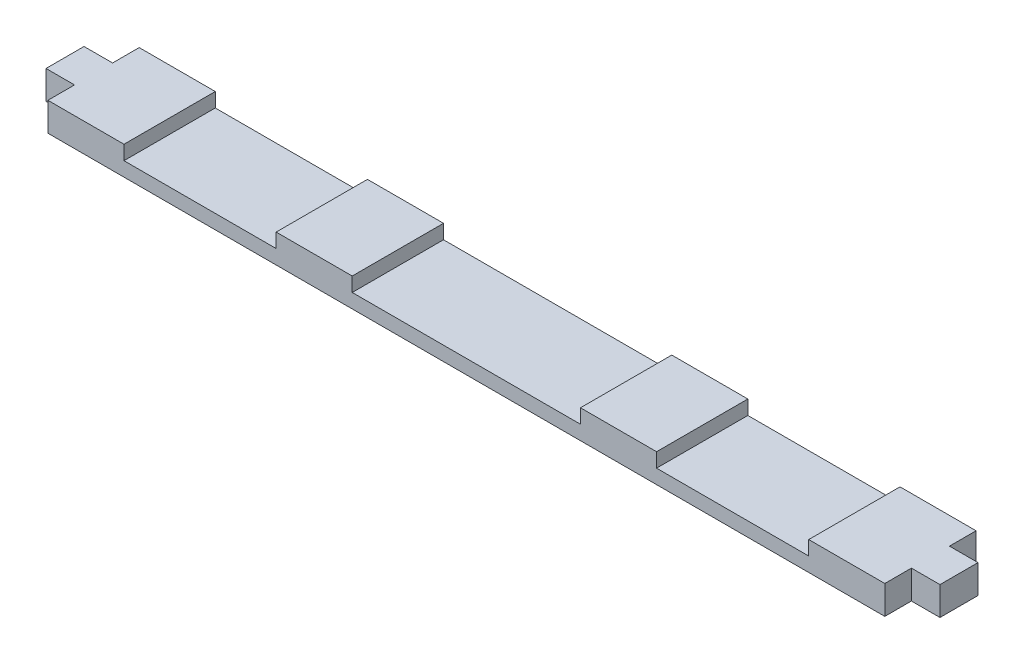
ISO-10303-21;
HEADER;
FILE_DESCRIPTION(('STEP AP214'),'2;1');
FILE_NAME('part.step','',(''),(''),'','','');
FILE_SCHEMA(('AUTOMOTIVE_DESIGN { 1 0 10303 214 1 1 1 1 }'));
ENDSEC;
DATA;
#1=APPLICATION_CONTEXT('core data for automotive mechanical design processes');
#2=APPLICATION_PROTOCOL_DEFINITION('international standard','automotive_design',2000,#1);
#3=PRODUCT_CONTEXT('',#1,'mechanical');
#4=PRODUCT('Part','Part','',(#3));
#5=PRODUCT_RELATED_PRODUCT_CATEGORY('part','',(#4));
#6=PRODUCT_DEFINITION_FORMATION('','',#4);
#7=PRODUCT_DEFINITION_CONTEXT('part definition',#1,'design');
#8=PRODUCT_DEFINITION('design','',#6,#7);
#9=PRODUCT_DEFINITION_SHAPE('','',#8);
#10=(LENGTH_UNIT() NAMED_UNIT(*) SI_UNIT(.MILLI.,.METRE.));
#11=(NAMED_UNIT(*) PLANE_ANGLE_UNIT() SI_UNIT($,.RADIAN.));
#12=(NAMED_UNIT(*) SI_UNIT($,.STERADIAN.) SOLID_ANGLE_UNIT());
#13=UNCERTAINTY_MEASURE_WITH_UNIT(LENGTH_MEASURE(1.E-05),#10,'distance_accuracy_value','');
#14=(GEOMETRIC_REPRESENTATION_CONTEXT(3) GLOBAL_UNCERTAINTY_ASSIGNED_CONTEXT((#13)) GLOBAL_UNIT_ASSIGNED_CONTEXT((#10,
#11,#12)) REPRESENTATION_CONTEXT('',''));
#15=CARTESIAN_POINT('',(0.,0.,0.));
#16=DIRECTION('',(0.,0.,1.));
#17=DIRECTION('',(1.,0.,0.));
#18=AXIS2_PLACEMENT_3D('',#15,#16,#17);
#19=CARTESIAN_POINT('',(0.,9.525,0.));
#20=DIRECTION('',(0.,1.,0.));
#21=DIRECTION('',(0.,0.,1.));
#22=AXIS2_PLACEMENT_3D('',#19,#20,#21);
#23=PLANE('',#22);
#24=DIRECTION('',(0.,0.,1.));
#25=VECTOR('',#24,1.);
#26=CARTESIAN_POINT('',(-114.3,9.525,-15.24));
#27=LINE('',#26,#25);
#28=CARTESIAN_POINT('',(-114.3,9.525,-15.24));
#29=VERTEX_POINT('',#28);
#30=CARTESIAN_POINT('',(-114.3,9.525,15.24));
#31=VERTEX_POINT('',#30);
#32=EDGE_CURVE('E216',#29,#31,#27,.T.);
#33=ORIENTED_EDGE('',*,*,#32,.F.);
#34=DIRECTION('',(-1.,0.,0.));
#35=VECTOR('',#34,1.);
#36=CARTESIAN_POINT('',(139.7,9.525,-15.24));
#37=LINE('',#36,#35);
#38=CARTESIAN_POINT('',(-139.7,9.525,-15.24));
#39=VERTEX_POINT('',#38);
#40=EDGE_CURVE('E242',#29,#39,#37,.T.);
#41=ORIENTED_EDGE('',*,*,#40,.T.);
#42=DIRECTION('',(0.,0.,1.));
#43=VECTOR('',#42,1.);
#44=CARTESIAN_POINT('',(-139.7,9.525,15.24));
#45=LINE('',#44,#43);
#46=CARTESIAN_POINT('',(-139.7,9.525,-6.35000000000001));
#47=VERTEX_POINT('',#46);
#48=EDGE_CURVE('E326',#39,#47,#45,.T.);
#49=ORIENTED_EDGE('',*,*,#48,.T.);
#50=DIRECTION('',(1.,0.,0.));
#51=VECTOR('',#50,1.);
#52=CARTESIAN_POINT('',(-149.225,9.525,-6.35000000000002));
#53=LINE('',#52,#51);
#54=CARTESIAN_POINT('',(-149.225,9.525,-6.35000000000002));
#55=VERTEX_POINT('',#54);
#56=EDGE_CURVE('E311',#55,#47,#53,.T.);
#57=ORIENTED_EDGE('',*,*,#56,.F.);
#58=DIRECTION('',(0.,0.,1.));
#59=VECTOR('',#58,1.);
#60=CARTESIAN_POINT('',(-149.225,9.525,6.34999999999998));
#61=LINE('',#60,#59);
#62=CARTESIAN_POINT('',(-149.225,9.525,6.34999999999998));
#63=VERTEX_POINT('',#62);
#64=EDGE_CURVE('E444',#55,#63,#61,.T.);
#65=ORIENTED_EDGE('',*,*,#64,.T.);
#66=DIRECTION('',(1.,0.,0.));
#67=VECTOR('',#66,1.);
#68=CARTESIAN_POINT('',(-149.225,9.525,6.34999999999998));
#69=LINE('',#68,#67);
#70=CARTESIAN_POINT('',(-139.7,9.525,6.34999999999998));
#71=VERTEX_POINT('',#70);
#72=EDGE_CURVE('E304',#63,#71,#69,.T.);
#73=ORIENTED_EDGE('',*,*,#72,.T.);
#74=CARTESIAN_POINT('',(-139.7,9.525,15.24));
#75=VERTEX_POINT('',#74);
#76=EDGE_CURVE('E263',#71,#75,#45,.T.);
#77=ORIENTED_EDGE('',*,*,#76,.T.);
#78=DIRECTION('',(1.,0.,0.));
#79=VECTOR('',#78,1.);
#80=CARTESIAN_POINT('',(139.7,9.525,15.24));
#81=LINE('',#80,#79);
#82=EDGE_CURVE('E330',#75,#31,#81,.T.);
#83=ORIENTED_EDGE('',*,*,#82,.T.);
#84=EDGE_LOOP('',(#33,#41,#49,#57,#65,#73,#77,#83));
#85=FACE_BOUND('',#84,.T.);
#86=ADVANCED_FACE('F42',(#85),#23,.T.);
#87=DIRECTION('',(0.,0.,1.));
#88=VECTOR('',#87,1.);
#89=CARTESIAN_POINT('',(63.5,9.525,-15.24));
#90=LINE('',#89,#88);
#91=CARTESIAN_POINT('',(63.5,9.525,-15.24));
#92=VERTEX_POINT('',#91);
#93=CARTESIAN_POINT('',(63.5,9.525,15.24));
#94=VERTEX_POINT('',#93);
#95=EDGE_CURVE('E206',#92,#94,#90,.T.);
#96=ORIENTED_EDGE('',*,*,#95,.F.);
#97=CARTESIAN_POINT('',(38.1,9.525,-15.24));
#98=VERTEX_POINT('',#97);
#99=EDGE_CURVE('E222',#92,#98,#37,.T.);
#100=ORIENTED_EDGE('',*,*,#99,.T.);
#101=DIRECTION('',(0.,0.,-1.));
#102=VECTOR('',#101,1.);
#103=CARTESIAN_POINT('',(38.1,9.525,-15.24));
#104=LINE('',#103,#102);
#105=CARTESIAN_POINT('',(38.1,9.525,15.24));
#106=VERTEX_POINT('',#105);
#107=EDGE_CURVE('E412',#106,#98,#104,.T.);
#108=ORIENTED_EDGE('',*,*,#107,.F.);
#109=EDGE_CURVE('E224',#106,#94,#81,.T.);
#110=ORIENTED_EDGE('',*,*,#109,.T.);
#111=EDGE_LOOP('',(#96,#100,#108,#110));
#112=FACE_BOUND('',#111,.T.);
#113=ADVANCED_FACE('F221',(#112),#23,.T.);
#114=DIRECTION('',(0.,0.,-1.));
#115=VECTOR('',#114,1.);
#116=CARTESIAN_POINT('',(-63.5,9.525,-15.24));
#117=LINE('',#116,#115);
#118=CARTESIAN_POINT('',(-63.5,9.525,15.24));
#119=VERTEX_POINT('',#118);
#120=CARTESIAN_POINT('',(-63.5,9.525,-15.24));
#121=VERTEX_POINT('',#120);
#122=EDGE_CURVE('E387',#119,#121,#117,.T.);
#123=ORIENTED_EDGE('',*,*,#122,.F.);
#124=CARTESIAN_POINT('',(-38.1,9.525,15.24));
#125=VERTEX_POINT('',#124);
#126=EDGE_CURVE('E334',#119,#125,#81,.T.);
#127=ORIENTED_EDGE('',*,*,#126,.T.);
#128=DIRECTION('',(0.,0.,1.));
#129=VECTOR('',#128,1.);
#130=CARTESIAN_POINT('',(-38.1,9.525,-15.24));
#131=LINE('',#130,#129);
#132=CARTESIAN_POINT('',(-38.1,9.525,-15.24));
#133=VERTEX_POINT('',#132);
#134=EDGE_CURVE('E226',#133,#125,#131,.T.);
#135=ORIENTED_EDGE('',*,*,#134,.F.);
#136=EDGE_CURVE('E236',#133,#121,#37,.T.);
#137=ORIENTED_EDGE('',*,*,#136,.T.);
#138=EDGE_LOOP('',(#123,#127,#135,#137));
#139=FACE_BOUND('',#138,.T.);
#140=ADVANCED_FACE('F532',(#139),#23,.T.);
#141=CARTESIAN_POINT('',(-139.7,9.525,15.24));
#142=DIRECTION('',(1.,0.,0.));
#143=DIRECTION('',(0.,0.,-1.));
#144=AXIS2_PLACEMENT_3D('',#141,#142,#143);
#145=PLANE('',#144);
#146=ORIENTED_EDGE('',*,*,#76,.F.);
#147=DIRECTION('',(0.,-1.,0.));
#148=VECTOR('',#147,1.);
#149=CARTESIAN_POINT('',(-139.7,0.,6.34999999999998));
#150=LINE('',#149,#148);
#151=CARTESIAN_POINT('',(-139.7,0.,6.34999999999998));
#152=VERTEX_POINT('',#151);
#153=EDGE_CURVE('E432',#71,#152,#150,.T.);
#154=ORIENTED_EDGE('',*,*,#153,.T.);
#155=DIRECTION('',(0.,0.,1.));
#156=VECTOR('',#155,1.);
#157=CARTESIAN_POINT('',(-139.7,0.,15.24));
#158=LINE('',#157,#156);
#159=CARTESIAN_POINT('',(-139.7,0.,15.24));
#160=VERTEX_POINT('',#159);
#161=EDGE_CURVE('E253',#152,#160,#158,.T.);
#162=ORIENTED_EDGE('',*,*,#161,.T.);
#163=DIRECTION('',(0.,-1.,0.));
#164=VECTOR('',#163,1.);
#165=CARTESIAN_POINT('',(-139.7,9.525,15.24));
#166=LINE('',#165,#164);
#167=EDGE_CURVE('E11',#75,#160,#166,.T.);
#168=ORIENTED_EDGE('',*,*,#167,.F.);
#169=EDGE_LOOP('',(#146,#154,#162,#168));
#170=FACE_BOUND('',#169,.T.);
#171=ADVANCED_FACE('F494',(#170),#145,.F.);
#172=CARTESIAN_POINT('',(139.7,9.525,15.24));
#173=DIRECTION('',(-1.,0.,0.));
#174=DIRECTION('',(0.,0.,1.));
#175=AXIS2_PLACEMENT_3D('',#172,#173,#174);
#176=PLANE('',#175);
#177=DIRECTION('',(0.,-1.,0.));
#178=VECTOR('',#177,1.);
#179=CARTESIAN_POINT('',(139.7,0.,6.34999999999998));
#180=LINE('',#179,#178);
#181=CARTESIAN_POINT('',(139.7,9.525,6.34999999999999));
#182=VERTEX_POINT('',#181);
#183=CARTESIAN_POINT('',(139.7,0.,6.34999999999999));
#184=VERTEX_POINT('',#183);
#185=EDGE_CURVE('E298',#182,#184,#180,.T.);
#186=ORIENTED_EDGE('',*,*,#185,.F.);
#187=DIRECTION('',(0.,0.,-1.));
#188=VECTOR('',#187,1.);
#189=CARTESIAN_POINT('',(139.7,9.525,15.24));
#190=LINE('',#189,#188);
#191=CARTESIAN_POINT('',(139.7,9.525,15.24));
#192=VERTEX_POINT('',#191);
#193=EDGE_CURVE('E246',#192,#182,#190,.T.);
#194=ORIENTED_EDGE('',*,*,#193,.F.);
#195=DIRECTION('',(0.,-1.,0.));
#196=VECTOR('',#195,1.);
#197=CARTESIAN_POINT('',(139.7,9.525,15.24));
#198=LINE('',#197,#196);
#199=CARTESIAN_POINT('',(139.7,0.,15.24));
#200=VERTEX_POINT('',#199);
#201=EDGE_CURVE('E51',#192,#200,#198,.T.);
#202=ORIENTED_EDGE('',*,*,#201,.T.);
#203=DIRECTION('',(0.,0.,-1.));
#204=VECTOR('',#203,1.);
#205=CARTESIAN_POINT('',(139.7,0.,15.24));
#206=LINE('',#205,#204);
#207=EDGE_CURVE('E257',#200,#184,#206,.T.);
#208=ORIENTED_EDGE('',*,*,#207,.T.);
#209=EDGE_LOOP('',(#186,#194,#202,#208));
#210=FACE_BOUND('',#209,.T.);
#211=ADVANCED_FACE('F276',(#210),#176,.F.);
#212=DIRECTION('',(0.,1.,0.));
#213=VECTOR('',#212,1.);
#214=CARTESIAN_POINT('',(139.7,0.,-6.35000000000002));
#215=LINE('',#214,#213);
#216=CARTESIAN_POINT('',(139.7,0.,-6.35000000000001));
#217=VERTEX_POINT('',#216);
#218=CARTESIAN_POINT('',(139.7,9.525,-6.35000000000002));
#219=VERTEX_POINT('',#218);
#220=EDGE_CURVE('E303',#217,#219,#215,.T.);
#221=ORIENTED_EDGE('',*,*,#220,.F.);
#222=CARTESIAN_POINT('',(139.7,0.,-15.24));
#223=VERTEX_POINT('',#222);
#224=EDGE_CURVE('E256',#217,#223,#206,.T.);
#225=ORIENTED_EDGE('',*,*,#224,.T.);
#226=DIRECTION('',(0.,-1.,0.));
#227=VECTOR('',#226,1.);
#228=CARTESIAN_POINT('',(139.7,9.525,-15.24));
#229=LINE('',#228,#227);
#230=CARTESIAN_POINT('',(139.7,9.525,-15.24));
#231=VERTEX_POINT('',#230);
#232=EDGE_CURVE('E267',#231,#223,#229,.T.);
#233=ORIENTED_EDGE('',*,*,#232,.F.);
#234=EDGE_CURVE('E333',#219,#231,#190,.T.);
#235=ORIENTED_EDGE('',*,*,#234,.F.);
#236=EDGE_LOOP('',(#221,#225,#233,#235));
#237=FACE_BOUND('',#236,.T.);
#238=ADVANCED_FACE('F487',(#237),#176,.F.);
#239=CARTESIAN_POINT('',(-139.7,0.,-15.24));
#240=VERTEX_POINT('',#239);
#241=CARTESIAN_POINT('',(-139.7,0.,-6.35000000000002));
#242=VERTEX_POINT('',#241);
#243=EDGE_CURVE('E248',#240,#242,#158,.T.);
#244=ORIENTED_EDGE('',*,*,#243,.T.);
#245=DIRECTION('',(0.,1.,0.));
#246=VECTOR('',#245,1.);
#247=CARTESIAN_POINT('',(-139.7,0.,-6.35000000000002));
#248=LINE('',#247,#246);
#249=EDGE_CURVE('E445',#242,#47,#248,.T.);
#250=ORIENTED_EDGE('',*,*,#249,.T.);
#251=ORIENTED_EDGE('',*,*,#48,.F.);
#252=DIRECTION('',(0.,-1.,0.));
#253=VECTOR('',#252,1.);
#254=CARTESIAN_POINT('',(-139.7,9.525,-15.24));
#255=LINE('',#254,#253);
#256=EDGE_CURVE('E241',#39,#240,#255,.T.);
#257=ORIENTED_EDGE('',*,*,#256,.T.);
#258=EDGE_LOOP('',(#244,#250,#251,#257));
#259=FACE_BOUND('',#258,.T.);
#260=ADVANCED_FACE('F44',(#259),#145,.F.);
#261=CARTESIAN_POINT('',(139.7,9.525,15.24));
#262=DIRECTION('',(0.,0.,-1.));
#263=DIRECTION('',(-1.,0.,0.));
#264=AXIS2_PLACEMENT_3D('',#261,#262,#263);
#265=PLANE('',#264);
#266=DIRECTION('',(1.,0.,0.));
#267=VECTOR('',#266,1.);
#268=CARTESIAN_POINT('',(-114.3,4.7625,15.24));
#269=LINE('',#268,#267);
#270=CARTESIAN_POINT('',(-114.3,4.7625,15.24));
#271=VERTEX_POINT('',#270);
#272=CARTESIAN_POINT('',(-63.5,4.7625,15.24));
#273=VERTEX_POINT('',#272);
#274=EDGE_CURVE('E400',#271,#273,#269,.T.);
#275=ORIENTED_EDGE('',*,*,#274,.F.);
#276=DIRECTION('',(0.,1.,0.));
#277=VECTOR('',#276,1.);
#278=CARTESIAN_POINT('',(-114.3,4.7625,15.24));
#279=LINE('',#278,#277);
#280=EDGE_CURVE('E372',#271,#31,#279,.T.);
#281=ORIENTED_EDGE('',*,*,#280,.T.);
#282=ORIENTED_EDGE('',*,*,#82,.F.);
#283=ORIENTED_EDGE('',*,*,#167,.T.);
#284=DIRECTION('',(1.,0.,0.));
#285=VECTOR('',#284,1.);
#286=CARTESIAN_POINT('',(139.7,0.,15.24));
#287=LINE('',#286,#285);
#288=EDGE_CURVE('E252',#160,#200,#287,.T.);
#289=ORIENTED_EDGE('',*,*,#288,.T.);
#290=ORIENTED_EDGE('',*,*,#201,.F.);
#291=CARTESIAN_POINT('',(114.3,9.525,15.24));
#292=VERTEX_POINT('',#291);
#293=EDGE_CURVE('E329',#292,#192,#81,.T.);
#294=ORIENTED_EDGE('',*,*,#293,.F.);
#295=DIRECTION('',(0.,1.,0.));
#296=VECTOR('',#295,1.);
#297=CARTESIAN_POINT('',(114.3,4.7625,15.24));
#298=LINE('',#297,#296);
#299=CARTESIAN_POINT('',(114.3,4.7625,15.24));
#300=VERTEX_POINT('',#299);
#301=EDGE_CURVE('E58',#300,#292,#298,.T.);
#302=ORIENTED_EDGE('',*,*,#301,.F.);
#303=DIRECTION('',(1.,0.,0.));
#304=VECTOR('',#303,1.);
#305=CARTESIAN_POINT('',(63.5,4.7625,15.24));
#306=LINE('',#305,#304);
#307=CARTESIAN_POINT('',(63.5,4.7625,15.24));
#308=VERTEX_POINT('',#307);
#309=EDGE_CURVE('E349',#308,#300,#306,.T.);
#310=ORIENTED_EDGE('',*,*,#309,.F.);
#311=DIRECTION('',(0.,1.,0.));
#312=VECTOR('',#311,1.);
#313=CARTESIAN_POINT('',(63.5,4.7625,15.24));
#314=LINE('',#313,#312);
#315=EDGE_CURVE('E351',#308,#94,#314,.T.);
#316=ORIENTED_EDGE('',*,*,#315,.T.);
#317=ORIENTED_EDGE('',*,*,#109,.F.);
#318=DIRECTION('',(0.,1.,0.));
#319=VECTOR('',#318,1.);
#320=CARTESIAN_POINT('',(38.1,4.7625,15.24));
#321=LINE('',#320,#319);
#322=CARTESIAN_POINT('',(38.1,4.7625,15.24));
#323=VERTEX_POINT('',#322);
#324=EDGE_CURVE('E66',#323,#106,#321,.T.);
#325=ORIENTED_EDGE('',*,*,#324,.F.);
#326=DIRECTION('',(1.,0.,0.));
#327=VECTOR('',#326,1.);
#328=CARTESIAN_POINT('',(-38.1,4.7625,15.24));
#329=LINE('',#328,#327);
#330=CARTESIAN_POINT('',(-38.1,4.7625,15.24));
#331=VERTEX_POINT('',#330);
#332=EDGE_CURVE('E411',#331,#323,#329,.T.);
#333=ORIENTED_EDGE('',*,*,#332,.F.);
#334=DIRECTION('',(0.,1.,0.));
#335=VECTOR('',#334,1.);
#336=CARTESIAN_POINT('',(-38.1,4.7625,15.24));
#337=LINE('',#336,#335);
#338=EDGE_CURVE('E424',#331,#125,#337,.T.);
#339=ORIENTED_EDGE('',*,*,#338,.T.);
#340=ORIENTED_EDGE('',*,*,#126,.F.);
#341=DIRECTION('',(0.,1.,0.));
#342=VECTOR('',#341,1.);
#343=CARTESIAN_POINT('',(-63.5,4.7625,15.24));
#344=LINE('',#343,#342);
#345=EDGE_CURVE('E377',#273,#119,#344,.T.);
#346=ORIENTED_EDGE('',*,*,#345,.F.);
#347=EDGE_LOOP('',(#275,#281,#282,#283,#289,#290,#294,#302,#310,#316,#317,#325,#333,#339,#340,#346));
#348=FACE_BOUND('',#347,.T.);
#349=ADVANCED_FACE('F346',(#348),#265,.F.);
#350=CARTESIAN_POINT('',(139.7,9.525,-15.24));
#351=DIRECTION('',(0.,0.,1.));
#352=DIRECTION('',(1.,0.,0.));
#353=AXIS2_PLACEMENT_3D('',#350,#351,#352);
#354=PLANE('',#353);
#355=ORIENTED_EDGE('',*,*,#40,.F.);
#356=DIRECTION('',(0.,1.,0.));
#357=VECTOR('',#356,1.);
#358=CARTESIAN_POINT('',(-114.3,4.7625,-15.24));
#359=LINE('',#358,#357);
#360=CARTESIAN_POINT('',(-114.3,4.7625,-15.24));
#361=VERTEX_POINT('',#360);
#362=EDGE_CURVE('E384',#361,#29,#359,.T.);
#363=ORIENTED_EDGE('',*,*,#362,.F.);
#364=DIRECTION('',(-1.,0.,0.));
#365=VECTOR('',#364,1.);
#366=CARTESIAN_POINT('',(-114.3,4.7625,-15.24));
#367=LINE('',#366,#365);
#368=CARTESIAN_POINT('',(-63.5,4.7625,-15.24));
#369=VERTEX_POINT('',#368);
#370=EDGE_CURVE('E376',#369,#361,#367,.T.);
#371=ORIENTED_EDGE('',*,*,#370,.F.);
#372=DIRECTION('',(0.,1.,0.));
#373=VECTOR('',#372,1.);
#374=CARTESIAN_POINT('',(-63.5,4.7625,-15.24));
#375=LINE('',#374,#373);
#376=EDGE_CURVE('E380',#369,#121,#375,.T.);
#377=ORIENTED_EDGE('',*,*,#376,.T.);
#378=ORIENTED_EDGE('',*,*,#136,.F.);
#379=DIRECTION('',(0.,1.,0.));
#380=VECTOR('',#379,1.);
#381=CARTESIAN_POINT('',(-38.1,4.7625,-15.24));
#382=LINE('',#381,#380);
#383=CARTESIAN_POINT('',(-38.1,4.7625,-15.24));
#384=VERTEX_POINT('',#383);
#385=EDGE_CURVE('E429',#384,#133,#382,.T.);
#386=ORIENTED_EDGE('',*,*,#385,.F.);
#387=DIRECTION('',(-1.,0.,0.));
#388=VECTOR('',#387,1.);
#389=CARTESIAN_POINT('',(-38.1,4.7625,-15.24));
#390=LINE('',#389,#388);
#391=CARTESIAN_POINT('',(38.1,4.7625,-15.24));
#392=VERTEX_POINT('',#391);
#393=EDGE_CURVE('E420',#392,#384,#390,.T.);
#394=ORIENTED_EDGE('',*,*,#393,.F.);
#395=DIRECTION('',(0.,1.,0.));
#396=VECTOR('',#395,1.);
#397=CARTESIAN_POINT('',(38.1,4.7625,-15.24));
#398=LINE('',#397,#396);
#399=EDGE_CURVE('E233',#392,#98,#398,.T.);
#400=ORIENTED_EDGE('',*,*,#399,.T.);
#401=ORIENTED_EDGE('',*,*,#99,.F.);
#402=DIRECTION('',(0.,1.,0.));
#403=VECTOR('',#402,1.);
#404=CARTESIAN_POINT('',(63.5,4.7625,-15.24));
#405=LINE('',#404,#403);
#406=CARTESIAN_POINT('',(63.5,4.7625,-15.24));
#407=VERTEX_POINT('',#406);
#408=EDGE_CURVE('E203',#407,#92,#405,.T.);
#409=ORIENTED_EDGE('',*,*,#408,.F.);
#410=DIRECTION('',(-1.,0.,0.));
#411=VECTOR('',#410,1.);
#412=CARTESIAN_POINT('',(63.5,4.7625,-15.24));
#413=LINE('',#412,#411);
#414=CARTESIAN_POINT('',(114.3,4.7625,-15.24));
#415=VERTEX_POINT('',#414);
#416=EDGE_CURVE('E355',#415,#407,#413,.T.);
#417=ORIENTED_EDGE('',*,*,#416,.F.);
#418=DIRECTION('',(0.,1.,0.));
#419=VECTOR('',#418,1.);
#420=CARTESIAN_POINT('',(114.3,4.7625,-15.24));
#421=LINE('',#420,#419);
#422=CARTESIAN_POINT('',(114.3,9.525,-15.24));
#423=VERTEX_POINT('',#422);
#424=EDGE_CURVE('E215',#415,#423,#421,.T.);
#425=ORIENTED_EDGE('',*,*,#424,.T.);
#426=EDGE_CURVE('E235',#231,#423,#37,.T.);
#427=ORIENTED_EDGE('',*,*,#426,.F.);
#428=ORIENTED_EDGE('',*,*,#232,.T.);
#429=DIRECTION('',(-1.,0.,0.));
#430=VECTOR('',#429,1.);
#431=CARTESIAN_POINT('',(139.7,0.,-15.24));
#432=LINE('',#431,#430);
#433=EDGE_CURVE('E260',#223,#240,#432,.T.);
#434=ORIENTED_EDGE('',*,*,#433,.T.);
#435=ORIENTED_EDGE('',*,*,#256,.F.);
#436=EDGE_LOOP('',(#355,#363,#371,#377,#378,#386,#394,#400,#401,#409,#417,#425,#427,#428,#434,#435));
#437=FACE_BOUND('',#436,.T.);
#438=ADVANCED_FACE('F231',(#437),#354,.F.);
#439=DIRECTION('',(0.,0.,-1.));
#440=VECTOR('',#439,1.);
#441=CARTESIAN_POINT('',(114.3,9.525,-15.24));
#442=LINE('',#441,#440);
#443=EDGE_CURVE('E227',#292,#423,#442,.T.);
#444=ORIENTED_EDGE('',*,*,#443,.F.);
#445=ORIENTED_EDGE('',*,*,#293,.T.);
#446=ORIENTED_EDGE('',*,*,#193,.T.);
#447=DIRECTION('',(-1.,0.,0.));
#448=VECTOR('',#447,1.);
#449=CARTESIAN_POINT('',(149.225,9.525,6.34999999999998));
#450=LINE('',#449,#448);
#451=CARTESIAN_POINT('',(149.225,9.525,6.34999999999998));
#452=VERTEX_POINT('',#451);
#453=EDGE_CURVE('E301',#452,#182,#450,.T.);
#454=ORIENTED_EDGE('',*,*,#453,.F.);
#455=DIRECTION('',(0.,0.,1.));
#456=VECTOR('',#455,1.);
#457=CARTESIAN_POINT('',(149.225,9.525,6.34999999999998));
#458=LINE('',#457,#456);
#459=CARTESIAN_POINT('',(149.225,9.525,-6.35000000000002));
#460=VERTEX_POINT('',#459);
#461=EDGE_CURVE('E314',#460,#452,#458,.T.);
#462=ORIENTED_EDGE('',*,*,#461,.F.);
#463=DIRECTION('',(-1.,0.,0.));
#464=VECTOR('',#463,1.);
#465=CARTESIAN_POINT('',(149.225,9.525,-6.35000000000002));
#466=LINE('',#465,#464);
#467=EDGE_CURVE('E319',#460,#219,#466,.T.);
#468=ORIENTED_EDGE('',*,*,#467,.T.);
#469=ORIENTED_EDGE('',*,*,#234,.T.);
#470=ORIENTED_EDGE('',*,*,#426,.T.);
#471=EDGE_LOOP('',(#444,#445,#446,#454,#462,#468,#469,#470));
#472=FACE_BOUND('',#471,.T.);
#473=ADVANCED_FACE('F344',(#472),#23,.T.);
#474=CARTESIAN_POINT('',(0.,0.,0.));
#475=DIRECTION('',(0.,1.,0.));
#476=DIRECTION('',(0.,0.,1.));
#477=AXIS2_PLACEMENT_3D('',#474,#475,#476);
#478=PLANE('',#477);
#479=ORIENTED_EDGE('',*,*,#243,.F.);
#480=ORIENTED_EDGE('',*,*,#433,.F.);
#481=ORIENTED_EDGE('',*,*,#224,.F.);
#482=DIRECTION('',(-1.,0.,0.));
#483=VECTOR('',#482,1.);
#484=CARTESIAN_POINT('',(149.225,0.,-6.35000000000002));
#485=LINE('',#484,#483);
#486=CARTESIAN_POINT('',(149.225,0.,-6.35000000000002));
#487=VERTEX_POINT('',#486);
#488=EDGE_CURVE('E295',#487,#217,#485,.T.);
#489=ORIENTED_EDGE('',*,*,#488,.F.);
#490=DIRECTION('',(0.,0.,-1.));
#491=VECTOR('',#490,1.);
#492=CARTESIAN_POINT('',(149.225,0.,6.34999999999998));
#493=LINE('',#492,#491);
#494=CARTESIAN_POINT('',(149.225,0.,6.34999999999998));
#495=VERTEX_POINT('',#494);
#496=EDGE_CURVE('E290',#495,#487,#493,.T.);
#497=ORIENTED_EDGE('',*,*,#496,.F.);
#498=DIRECTION('',(-1.,0.,0.));
#499=VECTOR('',#498,1.);
#500=CARTESIAN_POINT('',(149.225,0.,6.34999999999998));
#501=LINE('',#500,#499);
#502=EDGE_CURVE('E287',#495,#184,#501,.T.);
#503=ORIENTED_EDGE('',*,*,#502,.T.);
#504=ORIENTED_EDGE('',*,*,#207,.F.);
#505=ORIENTED_EDGE('',*,*,#288,.F.);
#506=ORIENTED_EDGE('',*,*,#161,.F.);
#507=DIRECTION('',(1.,0.,0.));
#508=VECTOR('',#507,1.);
#509=CARTESIAN_POINT('',(-149.225,0.,6.34999999999998));
#510=LINE('',#509,#508);
#511=CARTESIAN_POINT('',(-149.225,0.,6.34999999999998));
#512=VERTEX_POINT('',#511);
#513=EDGE_CURVE('E457',#512,#152,#510,.T.);
#514=ORIENTED_EDGE('',*,*,#513,.F.);
#515=DIRECTION('',(0.,0.,-1.));
#516=VECTOR('',#515,1.);
#517=CARTESIAN_POINT('',(-149.225,0.,6.34999999999998));
#518=LINE('',#517,#516);
#519=CARTESIAN_POINT('',(-149.225,0.,-6.35000000000002));
#520=VERTEX_POINT('',#519);
#521=EDGE_CURVE('E453',#512,#520,#518,.T.);
#522=ORIENTED_EDGE('',*,*,#521,.T.);
#523=DIRECTION('',(1.,0.,0.));
#524=VECTOR('',#523,1.);
#525=CARTESIAN_POINT('',(-149.225,0.,-6.35000000000002));
#526=LINE('',#525,#524);
#527=EDGE_CURVE('E466',#520,#242,#526,.T.);
#528=ORIENTED_EDGE('',*,*,#527,.T.);
#529=EDGE_LOOP('',(#479,#480,#481,#489,#497,#503,#504,#505,#506,#514,#522,#528));
#530=FACE_BOUND('',#529,.T.);
#531=ADVANCED_FACE('F284',(#530),#478,.F.);
#532=CARTESIAN_POINT('',(149.225,0.,6.34999999999998));
#533=DIRECTION('',(0.,0.,-1.));
#534=DIRECTION('',(-1.,0.,0.));
#535=AXIS2_PLACEMENT_3D('',#532,#533,#534);
#536=PLANE('',#535);
#537=ORIENTED_EDGE('',*,*,#185,.T.);
#538=ORIENTED_EDGE('',*,*,#502,.F.);
#539=DIRECTION('',(0.,-1.,0.));
#540=VECTOR('',#539,1.);
#541=CARTESIAN_POINT('',(149.225,0.,6.34999999999998));
#542=LINE('',#541,#540);
#543=EDGE_CURVE('E309',#452,#495,#542,.T.);
#544=ORIENTED_EDGE('',*,*,#543,.F.);
#545=ORIENTED_EDGE('',*,*,#453,.T.);
#546=EDGE_LOOP('',(#537,#538,#544,#545));
#547=FACE_BOUND('',#546,.T.);
#548=ADVANCED_FACE('F299',(#547),#536,.F.);
#549=CARTESIAN_POINT('',(149.225,0.,-6.35000000000002));
#550=DIRECTION('',(0.,0.,1.));
#551=DIRECTION('',(1.,0.,0.));
#552=AXIS2_PLACEMENT_3D('',#549,#550,#551);
#553=PLANE('',#552);
#554=ORIENTED_EDGE('',*,*,#220,.T.);
#555=ORIENTED_EDGE('',*,*,#467,.F.);
#556=DIRECTION('',(0.,1.,0.));
#557=VECTOR('',#556,1.);
#558=CARTESIAN_POINT('',(149.225,0.,-6.35000000000002));
#559=LINE('',#558,#557);
#560=EDGE_CURVE('E474',#487,#460,#559,.T.);
#561=ORIENTED_EDGE('',*,*,#560,.F.);
#562=ORIENTED_EDGE('',*,*,#488,.T.);
#563=EDGE_LOOP('',(#554,#555,#561,#562));
#564=FACE_BOUND('',#563,.T.);
#565=ADVANCED_FACE('F484',(#564),#553,.F.);
#566=CARTESIAN_POINT('',(149.225,0.,0.));
#567=DIRECTION('',(-1.,0.,0.));
#568=DIRECTION('',(0.,0.,1.));
#569=AXIS2_PLACEMENT_3D('',#566,#567,#568);
#570=PLANE('',#569);
#571=ORIENTED_EDGE('',*,*,#543,.T.);
#572=ORIENTED_EDGE('',*,*,#496,.T.);
#573=ORIENTED_EDGE('',*,*,#560,.T.);
#574=ORIENTED_EDGE('',*,*,#461,.T.);
#575=EDGE_LOOP('',(#571,#572,#573,#574));
#576=FACE_BOUND('',#575,.T.);
#577=ADVANCED_FACE('F481',(#576),#570,.F.);
#578=CARTESIAN_POINT('',(-149.225,0.,6.34999999999998));
#579=DIRECTION('',(0.,0.,1.));
#580=DIRECTION('',(1.,0.,0.));
#581=AXIS2_PLACEMENT_3D('',#578,#579,#580);
#582=PLANE('',#581);
#583=ORIENTED_EDGE('',*,*,#153,.F.);
#584=ORIENTED_EDGE('',*,*,#72,.F.);
#585=DIRECTION('',(0.,-1.,0.));
#586=VECTOR('',#585,1.);
#587=CARTESIAN_POINT('',(-149.225,0.,6.34999999999998));
#588=LINE('',#587,#586);
#589=EDGE_CURVE('E440',#63,#512,#588,.T.);
#590=ORIENTED_EDGE('',*,*,#589,.T.);
#591=ORIENTED_EDGE('',*,*,#513,.T.);
#592=EDGE_LOOP('',(#583,#584,#590,#591));
#593=FACE_BOUND('',#592,.T.);
#594=ADVANCED_FACE('F499',(#593),#582,.T.);
#595=CARTESIAN_POINT('',(-149.225,0.,-6.35000000000002));
#596=DIRECTION('',(0.,0.,-1.));
#597=DIRECTION('',(-1.,0.,0.));
#598=AXIS2_PLACEMENT_3D('',#595,#596,#597);
#599=PLANE('',#598);
#600=ORIENTED_EDGE('',*,*,#249,.F.);
#601=ORIENTED_EDGE('',*,*,#527,.F.);
#602=DIRECTION('',(0.,1.,0.));
#603=VECTOR('',#602,1.);
#604=CARTESIAN_POINT('',(-149.225,0.,-6.35000000000002));
#605=LINE('',#604,#603);
#606=EDGE_CURVE('E449',#520,#55,#605,.T.);
#607=ORIENTED_EDGE('',*,*,#606,.T.);
#608=ORIENTED_EDGE('',*,*,#56,.T.);
#609=EDGE_LOOP('',(#600,#601,#607,#608));
#610=FACE_BOUND('',#609,.T.);
#611=ADVANCED_FACE('F506',(#610),#599,.T.);
#612=CARTESIAN_POINT('',(-149.225,0.,0.));
#613=DIRECTION('',(1.,0.,0.));
#614=DIRECTION('',(0.,0.,1.));
#615=AXIS2_PLACEMENT_3D('',#612,#613,#614);
#616=PLANE('',#615);
#617=ORIENTED_EDGE('',*,*,#589,.F.);
#618=ORIENTED_EDGE('',*,*,#64,.F.);
#619=ORIENTED_EDGE('',*,*,#606,.F.);
#620=ORIENTED_EDGE('',*,*,#521,.F.);
#621=EDGE_LOOP('',(#617,#618,#619,#620));
#622=FACE_BOUND('',#621,.T.);
#623=ADVANCED_FACE('F503',(#622),#616,.F.);
#624=CARTESIAN_POINT('',(-38.1,4.7625,-15.24));
#625=DIRECTION('',(-1.,0.,0.));
#626=DIRECTION('',(0.,0.,1.));
#627=AXIS2_PLACEMENT_3D('',#624,#625,#626);
#628=PLANE('',#627);
#629=ORIENTED_EDGE('',*,*,#134,.T.);
#630=ORIENTED_EDGE('',*,*,#338,.F.);
#631=DIRECTION('',(0.,0.,1.));
#632=VECTOR('',#631,1.);
#633=CARTESIAN_POINT('',(-38.1,4.7625,-15.24));
#634=LINE('',#633,#632);
#635=EDGE_CURVE('E407',#384,#331,#634,.T.);
#636=ORIENTED_EDGE('',*,*,#635,.F.);
#637=ORIENTED_EDGE('',*,*,#385,.T.);
#638=EDGE_LOOP('',(#629,#630,#636,#637));
#639=FACE_BOUND('',#638,.T.);
#640=ADVANCED_FACE('F556',(#639),#628,.F.);
#641=CARTESIAN_POINT('',(38.1,4.7625,-15.24));
#642=DIRECTION('',(1.,0.,0.));
#643=DIRECTION('',(0.,0.,-1.));
#644=AXIS2_PLACEMENT_3D('',#641,#642,#643);
#645=PLANE('',#644);
#646=ORIENTED_EDGE('',*,*,#107,.T.);
#647=ORIENTED_EDGE('',*,*,#399,.F.);
#648=DIRECTION('',(0.,0.,-1.));
#649=VECTOR('',#648,1.);
#650=CARTESIAN_POINT('',(38.1,4.7625,-15.24));
#651=LINE('',#650,#649);
#652=EDGE_CURVE('E416',#323,#392,#651,.T.);
#653=ORIENTED_EDGE('',*,*,#652,.F.);
#654=ORIENTED_EDGE('',*,*,#324,.T.);
#655=EDGE_LOOP('',(#646,#647,#653,#654));
#656=FACE_BOUND('',#655,.T.);
#657=ADVANCED_FACE('F575',(#656),#645,.F.);
#658=CARTESIAN_POINT('',(0.,4.7625,0.));
#659=DIRECTION('',(0.,1.,0.));
#660=DIRECTION('',(0.,0.,1.));
#661=AXIS2_PLACEMENT_3D('',#658,#659,#660);
#662=PLANE('',#661);
#663=ORIENTED_EDGE('',*,*,#635,.T.);
#664=ORIENTED_EDGE('',*,*,#332,.T.);
#665=ORIENTED_EDGE('',*,*,#652,.T.);
#666=ORIENTED_EDGE('',*,*,#393,.T.);
#667=EDGE_LOOP('',(#663,#664,#665,#666));
#668=FACE_BOUND('',#667,.T.);
#669=ADVANCED_FACE('F558',(#668),#662,.T.);
#670=CARTESIAN_POINT('',(63.5,4.7625,-15.24));
#671=DIRECTION('',(-1.,0.,0.));
#672=DIRECTION('',(0.,0.,1.));
#673=AXIS2_PLACEMENT_3D('',#670,#671,#672);
#674=PLANE('',#673);
#675=ORIENTED_EDGE('',*,*,#95,.T.);
#676=ORIENTED_EDGE('',*,*,#315,.F.);
#677=DIRECTION('',(0.,0.,1.));
#678=VECTOR('',#677,1.);
#679=CARTESIAN_POINT('',(63.5,4.7625,-15.24));
#680=LINE('',#679,#678);
#681=EDGE_CURVE('E209',#407,#308,#680,.T.);
#682=ORIENTED_EDGE('',*,*,#681,.F.);
#683=ORIENTED_EDGE('',*,*,#408,.T.);
#684=EDGE_LOOP('',(#675,#676,#682,#683));
#685=FACE_BOUND('',#684,.T.);
#686=ADVANCED_FACE('F205',(#685),#674,.F.);
#687=CARTESIAN_POINT('',(114.3,4.7625,-15.24));
#688=DIRECTION('',(1.,0.,0.));
#689=DIRECTION('',(0.,0.,-1.));
#690=AXIS2_PLACEMENT_3D('',#687,#688,#689);
#691=PLANE('',#690);
#692=ORIENTED_EDGE('',*,*,#443,.T.);
#693=ORIENTED_EDGE('',*,*,#424,.F.);
#694=DIRECTION('',(0.,0.,-1.));
#695=VECTOR('',#694,1.);
#696=CARTESIAN_POINT('',(114.3,4.7625,-15.24));
#697=LINE('',#696,#695);
#698=EDGE_CURVE('E364',#300,#415,#697,.T.);
#699=ORIENTED_EDGE('',*,*,#698,.F.);
#700=ORIENTED_EDGE('',*,*,#301,.T.);
#701=EDGE_LOOP('',(#692,#693,#699,#700));
#702=FACE_BOUND('',#701,.T.);
#703=ADVANCED_FACE('F512',(#702),#691,.F.);
#704=CARTESIAN_POINT('',(0.,4.7625,0.));
#705=DIRECTION('',(0.,1.,0.));
#706=DIRECTION('',(0.,0.,1.));
#707=AXIS2_PLACEMENT_3D('',#704,#705,#706);
#708=PLANE('',#707);
#709=ORIENTED_EDGE('',*,*,#681,.T.);
#710=ORIENTED_EDGE('',*,*,#309,.T.);
#711=ORIENTED_EDGE('',*,*,#698,.T.);
#712=ORIENTED_EDGE('',*,*,#416,.T.);
#713=EDGE_LOOP('',(#709,#710,#711,#712));
#714=FACE_BOUND('',#713,.T.);
#715=ADVANCED_FACE('F514',(#714),#708,.T.);
#716=CARTESIAN_POINT('',(-114.3,4.7625,-15.24));
#717=DIRECTION('',(-1.,0.,0.));
#718=DIRECTION('',(0.,0.,1.));
#719=AXIS2_PLACEMENT_3D('',#716,#717,#718);
#720=PLANE('',#719);
#721=ORIENTED_EDGE('',*,*,#32,.T.);
#722=ORIENTED_EDGE('',*,*,#280,.F.);
#723=DIRECTION('',(0.,0.,1.));
#724=VECTOR('',#723,1.);
#725=CARTESIAN_POINT('',(-114.3,4.7625,-15.24));
#726=LINE('',#725,#724);
#727=EDGE_CURVE('E390',#361,#271,#726,.T.);
#728=ORIENTED_EDGE('',*,*,#727,.F.);
#729=ORIENTED_EDGE('',*,*,#362,.T.);
#730=EDGE_LOOP('',(#721,#722,#728,#729));
#731=FACE_BOUND('',#730,.T.);
#732=ADVANCED_FACE('F516',(#731),#720,.F.);
#733=CARTESIAN_POINT('',(-63.5,4.7625,-15.24));
#734=DIRECTION('',(1.,0.,0.));
#735=DIRECTION('',(0.,0.,-1.));
#736=AXIS2_PLACEMENT_3D('',#733,#734,#735);
#737=PLANE('',#736);
#738=ORIENTED_EDGE('',*,*,#122,.T.);
#739=ORIENTED_EDGE('',*,*,#376,.F.);
#740=DIRECTION('',(0.,0.,-1.));
#741=VECTOR('',#740,1.);
#742=CARTESIAN_POINT('',(-63.5,4.7625,-15.24));
#743=LINE('',#742,#741);
#744=EDGE_CURVE('E396',#273,#369,#743,.T.);
#745=ORIENTED_EDGE('',*,*,#744,.F.);
#746=ORIENTED_EDGE('',*,*,#345,.T.);
#747=EDGE_LOOP('',(#738,#739,#745,#746));
#748=FACE_BOUND('',#747,.T.);
#749=ADVANCED_FACE('F522',(#748),#737,.F.);
#750=CARTESIAN_POINT('',(0.,4.7625,0.));
#751=DIRECTION('',(0.,1.,0.));
#752=DIRECTION('',(0.,0.,1.));
#753=AXIS2_PLACEMENT_3D('',#750,#751,#752);
#754=PLANE('',#753);
#755=ORIENTED_EDGE('',*,*,#727,.T.);
#756=ORIENTED_EDGE('',*,*,#274,.T.);
#757=ORIENTED_EDGE('',*,*,#744,.T.);
#758=ORIENTED_EDGE('',*,*,#370,.T.);
#759=EDGE_LOOP('',(#755,#756,#757,#758));
#760=FACE_BOUND('',#759,.T.);
#761=ADVANCED_FACE('F562',(#760),#754,.T.);
#762=CLOSED_SHELL('',(#86,#113,#140,#171,#211,#238,#260,#349,#438,#473,#531,#548,#565,#577,#594,
#611,#623,#640,#657,#669,#686,#703,#715,#732,#749,#761));
#763=MANIFOLD_SOLID_BREP('B2',#762);
#764=ADVANCED_BREP_SHAPE_REPRESENTATION('',(#18,#763),#14);
#765=SHAPE_DEFINITION_REPRESENTATION(#9,#764);
ENDSEC;
END-ISO-10303-21;
